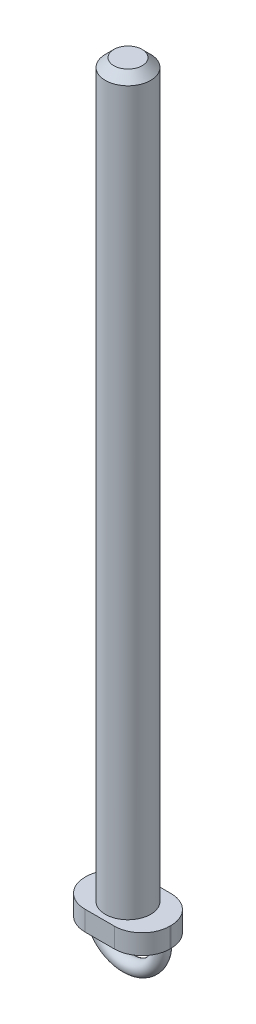
ISO-10303-21;
HEADER;
FILE_DESCRIPTION(('STEP AP214'),'2;1');
FILE_NAME('part.step','',(''),(''),'','','');
FILE_SCHEMA(('AUTOMOTIVE_DESIGN { 1 0 10303 214 1 1 1 1 }'));
ENDSEC;
DATA;
#1=APPLICATION_CONTEXT('core data for automotive mechanical design processes');
#2=APPLICATION_PROTOCOL_DEFINITION('international standard','automotive_design',2000,#1);
#3=PRODUCT_CONTEXT('',#1,'mechanical');
#4=PRODUCT('Part','Part','',(#3));
#5=PRODUCT_RELATED_PRODUCT_CATEGORY('part','',(#4));
#6=PRODUCT_DEFINITION_FORMATION('','',#4);
#7=PRODUCT_DEFINITION_CONTEXT('part definition',#1,'design');
#8=PRODUCT_DEFINITION('design','',#6,#7);
#9=PRODUCT_DEFINITION_SHAPE('','',#8);
#10=(LENGTH_UNIT() NAMED_UNIT(*) SI_UNIT(.MILLI.,.METRE.));
#11=(NAMED_UNIT(*) PLANE_ANGLE_UNIT() SI_UNIT($,.RADIAN.));
#12=(NAMED_UNIT(*) SI_UNIT($,.STERADIAN.) SOLID_ANGLE_UNIT());
#13=UNCERTAINTY_MEASURE_WITH_UNIT(LENGTH_MEASURE(1.E-05),#10,'distance_accuracy_value','');
#14=(GEOMETRIC_REPRESENTATION_CONTEXT(3) GLOBAL_UNCERTAINTY_ASSIGNED_CONTEXT((#13)) GLOBAL_UNIT_ASSIGNED_CONTEXT((#10,
#11,#12)) REPRESENTATION_CONTEXT('',''));
#15=CARTESIAN_POINT('',(0.,0.,0.));
#16=DIRECTION('',(0.,0.,1.));
#17=DIRECTION('',(1.,0.,0.));
#18=AXIS2_PLACEMENT_3D('',#15,#16,#17);
#19=CARTESIAN_POINT('',(0.,0.,0.));
#20=DIRECTION('',(0.,1.,0.));
#21=DIRECTION('',(-1.,0.,0.));
#22=AXIS2_PLACEMENT_3D('',#19,#20,#21);
#23=PLANE('',#22);
#24=CARTESIAN_POINT('',(6.,0.,0.));
#25=DIRECTION('',(0.,1.,0.));
#26=DIRECTION('',(-1.,0.,0.));
#27=AXIS2_PLACEMENT_3D('',#24,#25,#26);
#28=CIRCLE('',#27,1.25);
#29=CARTESIAN_POINT('',(7.25,1.02880155875736E-13,0.));
#30=VERTEX_POINT('',#29);
#31=EDGE_CURVE('E172',#30,#30,#28,.T.);
#32=ORIENTED_EDGE('',*,*,#31,.T.);
#33=EDGE_LOOP('',(#32));
#34=FACE_BOUND('',#33,.T.);
#35=CARTESIAN_POINT('',(2.6,0.,-0.0999999999999985));
#36=DIRECTION('',(0.,-1.,0.));
#37=DIRECTION('',(1.,0.,0.));
#38=AXIS2_PLACEMENT_3D('',#35,#36,#37);
#39=CIRCLE('',#38,4.9);
#40=CARTESIAN_POINT('',(2.59999999999996,0.,-5.));
#41=VERTEX_POINT('',#40);
#42=CARTESIAN_POINT('',(7.5,0.,-0.0999999999999638));
#43=VERTEX_POINT('',#42);
#44=EDGE_CURVE('E48',#41,#43,#39,.T.);
#45=ORIENTED_EDGE('',*,*,#44,.T.);
#46=DIRECTION('',(0.,0.,1.));
#47=VECTOR('',#46,1.);
#48=CARTESIAN_POINT('',(7.5,0.,0.));
#49=LINE('',#48,#47);
#50=CARTESIAN_POINT('',(7.5,0.,0.0999999999999656));
#51=VERTEX_POINT('',#50);
#52=EDGE_CURVE('E130',#43,#51,#49,.T.);
#53=ORIENTED_EDGE('',*,*,#52,.T.);
#54=CARTESIAN_POINT('',(2.6,0.,0.1));
#55=DIRECTION('',(0.,-1.,0.));
#56=DIRECTION('',(1.,0.,0.));
#57=AXIS2_PLACEMENT_3D('',#54,#55,#56);
#58=CIRCLE('',#57,4.9);
#59=CARTESIAN_POINT('',(2.59999999999996,0.,5.));
#60=VERTEX_POINT('',#59);
#61=EDGE_CURVE('E127',#51,#60,#58,.T.);
#62=ORIENTED_EDGE('',*,*,#61,.T.);
#63=DIRECTION('',(-1.,0.,0.));
#64=VECTOR('',#63,1.);
#65=CARTESIAN_POINT('',(0.,0.,5.));
#66=LINE('',#65,#64);
#67=CARTESIAN_POINT('',(-2.59999999999996,0.,5.));
#68=VERTEX_POINT('',#67);
#69=EDGE_CURVE('E124',#60,#68,#66,.T.);
#70=ORIENTED_EDGE('',*,*,#69,.T.);
#71=CARTESIAN_POINT('',(-2.6,0.,0.0999999999999985));
#72=DIRECTION('',(0.,-1.,0.));
#73=DIRECTION('',(1.,0.,0.));
#74=AXIS2_PLACEMENT_3D('',#71,#72,#73);
#75=CIRCLE('',#74,4.9);
#76=CARTESIAN_POINT('',(-7.5,0.,0.0999999999999638));
#77=VERTEX_POINT('',#76);
#78=EDGE_CURVE('E119',#68,#77,#75,.T.);
#79=ORIENTED_EDGE('',*,*,#78,.T.);
#80=DIRECTION('',(0.,0.,1.));
#81=VECTOR('',#80,1.);
#82=CARTESIAN_POINT('',(-7.5,0.,0.));
#83=LINE('',#82,#81);
#84=CARTESIAN_POINT('',(-7.5,0.,-0.0999999999999656));
#85=VERTEX_POINT('',#84);
#86=EDGE_CURVE('E117',#85,#77,#83,.T.);
#87=ORIENTED_EDGE('',*,*,#86,.F.);
#88=CARTESIAN_POINT('',(-2.6,0.,-0.0999999999999994));
#89=DIRECTION('',(0.,-1.,0.));
#90=DIRECTION('',(1.,0.,0.));
#91=AXIS2_PLACEMENT_3D('',#88,#89,#90);
#92=CIRCLE('',#91,4.9);
#93=CARTESIAN_POINT('',(-2.59999999999996,0.,-5.));
#94=VERTEX_POINT('',#93);
#95=EDGE_CURVE('E101',#94,#85,#92,.F.);
#96=ORIENTED_EDGE('',*,*,#95,.F.);
#97=DIRECTION('',(-1.,0.,0.));
#98=VECTOR('',#97,1.);
#99=CARTESIAN_POINT('',(0.,0.,-5.));
#100=LINE('',#99,#98);
#101=EDGE_CURVE('E110',#41,#94,#100,.T.);
#102=ORIENTED_EDGE('',*,*,#101,.F.);
#103=EDGE_LOOP('',(#45,#53,#62,#70,#79,#87,#96,#102));
#104=FACE_BOUND('',#103,.T.);
#105=CARTESIAN_POINT('',(-6.,0.,0.));
#106=DIRECTION('',(0.,-1.,0.));
#107=DIRECTION('',(1.,0.,0.));
#108=AXIS2_PLACEMENT_3D('',#105,#106,#107);
#109=CIRCLE('',#108,1.25);
#110=CARTESIAN_POINT('',(-7.25,0.,0.));
#111=VERTEX_POINT('',#110);
#112=EDGE_CURVE('E163',#111,#111,#109,.T.);
#113=ORIENTED_EDGE('',*,*,#112,.F.);
#114=EDGE_LOOP('',(#113));
#115=FACE_BOUND('',#114,.T.);
#116=ADVANCED_FACE('F33',(#34,#104,#115),#23,.F.);
#117=CARTESIAN_POINT('',(11.,3.5,0.));
#118=DIRECTION('',(0.,-1.,0.));
#119=DIRECTION('',(1.,0.,0.));
#120=AXIS2_PLACEMENT_3D('',#117,#118,#119);
#121=PLANE('',#120);
#122=CARTESIAN_POINT('',(0.,3.5,0.));
#123=DIRECTION('',(0.,1.,0.));
#124=DIRECTION('',(-1.,0.,0.));
#125=AXIS2_PLACEMENT_3D('',#122,#123,#124);
#126=CIRCLE('',#125,4.);
#127=CARTESIAN_POINT('',(-4.,3.5,0.));
#128=VERTEX_POINT('',#127);
#129=EDGE_CURVE('E135',#128,#128,#126,.T.);
#130=ORIENTED_EDGE('',*,*,#129,.F.);
#131=EDGE_LOOP('',(#130));
#132=FACE_BOUND('',#131,.T.);
#133=CARTESIAN_POINT('',(2.6,3.5,-0.0999999999999985));
#134=DIRECTION('',(0.,-1.,0.));
#135=DIRECTION('',(1.,0.,0.));
#136=AXIS2_PLACEMENT_3D('',#133,#134,#135);
#137=CIRCLE('',#136,4.9);
#138=CARTESIAN_POINT('',(2.59999999999996,3.5,-5.));
#139=VERTEX_POINT('',#138);
#140=CARTESIAN_POINT('',(7.5,3.5,-0.0999999999999638));
#141=VERTEX_POINT('',#140);
#142=EDGE_CURVE('E162',#139,#141,#137,.T.);
#143=ORIENTED_EDGE('',*,*,#142,.F.);
#144=DIRECTION('',(-1.,0.,0.));
#145=VECTOR('',#144,1.);
#146=CARTESIAN_POINT('',(11.,3.5,-5.));
#147=LINE('',#146,#145);
#148=CARTESIAN_POINT('',(-2.59999999999997,3.5,-5.));
#149=VERTEX_POINT('',#148);
#150=EDGE_CURVE('E148',#139,#149,#147,.T.);
#151=ORIENTED_EDGE('',*,*,#150,.T.);
#152=CARTESIAN_POINT('',(-2.6,3.5,-0.0999999999999994));
#153=DIRECTION('',(0.,-1.,0.));
#154=DIRECTION('',(1.,0.,0.));
#155=AXIS2_PLACEMENT_3D('',#152,#153,#154);
#156=CIRCLE('',#155,4.9);
#157=CARTESIAN_POINT('',(-7.5,3.5,-0.0999999999999656));
#158=VERTEX_POINT('',#157);
#159=EDGE_CURVE('E104',#149,#158,#156,.F.);
#160=ORIENTED_EDGE('',*,*,#159,.T.);
#161=DIRECTION('',(0.,0.,1.));
#162=VECTOR('',#161,1.);
#163=CARTESIAN_POINT('',(-7.5,3.5,0.));
#164=LINE('',#163,#162);
#165=CARTESIAN_POINT('',(-7.5,3.5,0.0999999999999638));
#166=VERTEX_POINT('',#165);
#167=EDGE_CURVE('E151',#158,#166,#164,.T.);
#168=ORIENTED_EDGE('',*,*,#167,.T.);
#169=CARTESIAN_POINT('',(-2.6,3.5,0.0999999999999985));
#170=DIRECTION('',(0.,-1.,0.));
#171=DIRECTION('',(1.,0.,0.));
#172=AXIS2_PLACEMENT_3D('',#169,#170,#171);
#173=CIRCLE('',#172,4.9);
#174=CARTESIAN_POINT('',(-2.59999999999996,3.5,5.));
#175=VERTEX_POINT('',#174);
#176=EDGE_CURVE('E154',#175,#166,#173,.T.);
#177=ORIENTED_EDGE('',*,*,#176,.F.);
#178=DIRECTION('',(-1.,0.,0.));
#179=VECTOR('',#178,1.);
#180=CARTESIAN_POINT('',(11.,3.5,5.));
#181=LINE('',#180,#179);
#182=CARTESIAN_POINT('',(2.59999999999996,3.5,5.));
#183=VERTEX_POINT('',#182);
#184=EDGE_CURVE('E156',#183,#175,#181,.T.);
#185=ORIENTED_EDGE('',*,*,#184,.F.);
#186=CARTESIAN_POINT('',(2.6,3.5,0.1));
#187=DIRECTION('',(0.,-1.,0.));
#188=DIRECTION('',(1.,0.,0.));
#189=AXIS2_PLACEMENT_3D('',#186,#187,#188);
#190=CIRCLE('',#189,4.9);
#191=CARTESIAN_POINT('',(7.5,3.5,0.0999999999999656));
#192=VERTEX_POINT('',#191);
#193=EDGE_CURVE('E158',#192,#183,#190,.T.);
#194=ORIENTED_EDGE('',*,*,#193,.F.);
#195=DIRECTION('',(0.,0.,1.));
#196=VECTOR('',#195,1.);
#197=CARTESIAN_POINT('',(7.5,3.5,0.));
#198=LINE('',#197,#196);
#199=EDGE_CURVE('E160',#141,#192,#198,.T.);
#200=ORIENTED_EDGE('',*,*,#199,.F.);
#201=EDGE_LOOP('',(#143,#151,#160,#168,#177,#185,#194,#200));
#202=FACE_BOUND('',#201,.T.);
#203=ADVANCED_FACE('F199',(#132,#202),#121,.F.);
#204=CARTESIAN_POINT('',(0.,132.66,0.));
#205=DIRECTION('',(0.,1.,0.));
#206=DIRECTION('',(-1.,0.,0.));
#207=AXIS2_PLACEMENT_3D('',#204,#205,#206);
#208=CYLINDRICAL_SURFACE('',#207,4.00000000000002);
#209=CARTESIAN_POINT('',(0.,131.16,0.));
#210=DIRECTION('',(0.,-1.,0.));
#211=DIRECTION('',(1.,0.,0.));
#212=AXIS2_PLACEMENT_3D('',#209,#210,#211);
#213=CIRCLE('',#212,4.00000000000002);
#214=CARTESIAN_POINT('',(4.,131.16,0.));
#215=VERTEX_POINT('',#214);
#216=EDGE_CURVE('E11',#215,#215,#213,.T.);
#217=ORIENTED_EDGE('',*,*,#216,.T.);
#218=EDGE_LOOP('',(#217));
#219=FACE_BOUND('',#218,.T.);
#220=ORIENTED_EDGE('',*,*,#129,.T.);
#221=EDGE_LOOP('',(#220));
#222=FACE_BOUND('',#221,.T.);
#223=ADVANCED_FACE('F210',(#219,#222),#208,.T.);
#224=CARTESIAN_POINT('',(4.00000000000002,132.66,0.));
#225=DIRECTION('',(0.,-1.,0.));
#226=DIRECTION('',(1.,0.,0.));
#227=AXIS2_PLACEMENT_3D('',#224,#225,#226);
#228=PLANE('',#227);
#229=CARTESIAN_POINT('',(0.,132.66,0.));
#230=DIRECTION('',(0.,-1.,0.));
#231=DIRECTION('',(1.,0.,0.));
#232=AXIS2_PLACEMENT_3D('',#229,#230,#231);
#233=CIRCLE('',#232,2.50000000000004);
#234=CARTESIAN_POINT('',(2.50000000000003,132.66,0.));
#235=VERTEX_POINT('',#234);
#236=EDGE_CURVE('E41',#235,#235,#233,.F.);
#237=ORIENTED_EDGE('',*,*,#236,.T.);
#238=EDGE_LOOP('',(#237));
#239=FACE_BOUND('',#238,.T.);
#240=ADVANCED_FACE('F202',(#239),#228,.F.);
#241=CARTESIAN_POINT('',(2.6,10.,-0.0999999999999985));
#242=DIRECTION('',(0.,-1.,0.));
#243=DIRECTION('',(1.,0.,0.));
#244=AXIS2_PLACEMENT_3D('',#241,#242,#243);
#245=CYLINDRICAL_SURFACE('',#244,4.9);
#246=ORIENTED_EDGE('',*,*,#142,.T.);
#247=DIRECTION('',(0.,-1.,0.));
#248=VECTOR('',#247,1.);
#249=CARTESIAN_POINT('',(7.5,10.,-0.0999999999999638));
#250=LINE('',#249,#248);
#251=EDGE_CURVE('E133',#141,#43,#250,.T.);
#252=ORIENTED_EDGE('',*,*,#251,.T.);
#253=ORIENTED_EDGE('',*,*,#44,.F.);
#254=DIRECTION('',(0.,-1.,0.));
#255=VECTOR('',#254,1.);
#256=CARTESIAN_POINT('',(2.59999999999996,10.,-5.));
#257=LINE('',#256,#255);
#258=EDGE_CURVE('E107',#139,#41,#257,.T.);
#259=ORIENTED_EDGE('',*,*,#258,.F.);
#260=EDGE_LOOP('',(#246,#252,#253,#259));
#261=FACE_BOUND('',#260,.T.);
#262=ADVANCED_FACE('F200',(#261),#245,.T.);
#263=CARTESIAN_POINT('',(7.5,10.,0.));
#264=DIRECTION('',(1.,0.,0.));
#265=DIRECTION('',(0.,1.,0.));
#266=AXIS2_PLACEMENT_3D('',#263,#264,#265);
#267=PLANE('',#266);
#268=ORIENTED_EDGE('',*,*,#199,.T.);
#269=DIRECTION('',(0.,-1.,0.));
#270=VECTOR('',#269,1.);
#271=CARTESIAN_POINT('',(7.5,10.,0.0999999999999656));
#272=LINE('',#271,#270);
#273=EDGE_CURVE('E136',#192,#51,#272,.T.);
#274=ORIENTED_EDGE('',*,*,#273,.T.);
#275=ORIENTED_EDGE('',*,*,#52,.F.);
#276=ORIENTED_EDGE('',*,*,#251,.F.);
#277=EDGE_LOOP('',(#268,#274,#275,#276));
#278=FACE_BOUND('',#277,.T.);
#279=ADVANCED_FACE('F178',(#278),#267,.T.);
#280=CARTESIAN_POINT('',(2.6,10.,0.1));
#281=DIRECTION('',(0.,-1.,0.));
#282=DIRECTION('',(1.,0.,0.));
#283=AXIS2_PLACEMENT_3D('',#280,#281,#282);
#284=CYLINDRICAL_SURFACE('',#283,4.9);
#285=ORIENTED_EDGE('',*,*,#193,.T.);
#286=DIRECTION('',(0.,-1.,0.));
#287=VECTOR('',#286,1.);
#288=CARTESIAN_POINT('',(2.59999999999996,10.,5.));
#289=LINE('',#288,#287);
#290=EDGE_CURVE('E138',#183,#60,#289,.T.);
#291=ORIENTED_EDGE('',*,*,#290,.T.);
#292=ORIENTED_EDGE('',*,*,#61,.F.);
#293=ORIENTED_EDGE('',*,*,#273,.F.);
#294=EDGE_LOOP('',(#285,#291,#292,#293));
#295=FACE_BOUND('',#294,.T.);
#296=ADVANCED_FACE('F183',(#295),#284,.T.);
#297=CARTESIAN_POINT('',(0.,10.,5.));
#298=DIRECTION('',(0.,0.,1.));
#299=DIRECTION('',(1.,0.,0.));
#300=AXIS2_PLACEMENT_3D('',#297,#298,#299);
#301=PLANE('',#300);
#302=ORIENTED_EDGE('',*,*,#184,.T.);
#303=DIRECTION('',(0.,-1.,0.));
#304=VECTOR('',#303,1.);
#305=CARTESIAN_POINT('',(-2.59999999999997,10.,5.));
#306=LINE('',#305,#304);
#307=EDGE_CURVE('E140',#175,#68,#306,.T.);
#308=ORIENTED_EDGE('',*,*,#307,.T.);
#309=ORIENTED_EDGE('',*,*,#69,.F.);
#310=ORIENTED_EDGE('',*,*,#290,.F.);
#311=EDGE_LOOP('',(#302,#308,#309,#310));
#312=FACE_BOUND('',#311,.T.);
#313=ADVANCED_FACE('F188',(#312),#301,.T.);
#314=CARTESIAN_POINT('',(-2.6,10.,0.0999999999999985));
#315=DIRECTION('',(0.,-1.,0.));
#316=DIRECTION('',(1.,0.,0.));
#317=AXIS2_PLACEMENT_3D('',#314,#315,#316);
#318=CYLINDRICAL_SURFACE('',#317,4.9);
#319=ORIENTED_EDGE('',*,*,#176,.T.);
#320=DIRECTION('',(0.,-1.,0.));
#321=VECTOR('',#320,1.);
#322=CARTESIAN_POINT('',(-7.5,10.,0.0999999999999638));
#323=LINE('',#322,#321);
#324=EDGE_CURVE('E142',#166,#77,#323,.T.);
#325=ORIENTED_EDGE('',*,*,#324,.T.);
#326=ORIENTED_EDGE('',*,*,#78,.F.);
#327=ORIENTED_EDGE('',*,*,#307,.F.);
#328=EDGE_LOOP('',(#319,#325,#326,#327));
#329=FACE_BOUND('',#328,.T.);
#330=ADVANCED_FACE('F192',(#329),#318,.T.);
#331=CARTESIAN_POINT('',(-7.5,10.,0.));
#332=DIRECTION('',(1.,0.,0.));
#333=DIRECTION('',(0.,1.,0.));
#334=AXIS2_PLACEMENT_3D('',#331,#332,#333);
#335=PLANE('',#334);
#336=DIRECTION('',(0.,-1.,0.));
#337=VECTOR('',#336,1.);
#338=CARTESIAN_POINT('',(-7.5,10.,-0.0999999999999656));
#339=LINE('',#338,#337);
#340=EDGE_CURVE('E106',#158,#85,#339,.T.);
#341=ORIENTED_EDGE('',*,*,#340,.T.);
#342=ORIENTED_EDGE('',*,*,#86,.T.);
#343=ORIENTED_EDGE('',*,*,#324,.F.);
#344=ORIENTED_EDGE('',*,*,#167,.F.);
#345=EDGE_LOOP('',(#341,#342,#343,#344));
#346=FACE_BOUND('',#345,.T.);
#347=ADVANCED_FACE('F196',(#346),#335,.F.);
#348=CARTESIAN_POINT('',(-2.6,10.,-0.0999999999999994));
#349=DIRECTION('',(0.,-1.,0.));
#350=DIRECTION('',(1.,0.,0.));
#351=AXIS2_PLACEMENT_3D('',#348,#349,#350);
#352=CYLINDRICAL_SURFACE('',#351,4.9);
#353=DIRECTION('',(0.,-1.,0.));
#354=VECTOR('',#353,1.);
#355=CARTESIAN_POINT('',(-2.59999999999997,10.,-5.));
#356=LINE('',#355,#354);
#357=EDGE_CURVE('E56',#149,#94,#356,.T.);
#358=ORIENTED_EDGE('',*,*,#357,.T.);
#359=ORIENTED_EDGE('',*,*,#95,.T.);
#360=ORIENTED_EDGE('',*,*,#340,.F.);
#361=ORIENTED_EDGE('',*,*,#159,.F.);
#362=EDGE_LOOP('',(#358,#359,#360,#361));
#363=FACE_BOUND('',#362,.T.);
#364=ADVANCED_FACE('F98',(#363),#352,.T.);
#365=CARTESIAN_POINT('',(0.,10.,-5.));
#366=DIRECTION('',(0.,0.,1.));
#367=DIRECTION('',(1.,0.,0.));
#368=AXIS2_PLACEMENT_3D('',#365,#366,#367);
#369=PLANE('',#368);
#370=ORIENTED_EDGE('',*,*,#258,.T.);
#371=ORIENTED_EDGE('',*,*,#101,.T.);
#372=ORIENTED_EDGE('',*,*,#357,.F.);
#373=ORIENTED_EDGE('',*,*,#150,.F.);
#374=EDGE_LOOP('',(#370,#371,#372,#373));
#375=FACE_BOUND('',#374,.T.);
#376=ADVANCED_FACE('F111',(#375),#369,.F.);
#377=CARTESIAN_POINT('',(0.,0.,0.));
#378=DIRECTION('',(0.,0.,-1.));
#379=DIRECTION('',(-1.,0.,0.));
#380=AXIS2_PLACEMENT_3D('',#377,#378,#379);
#381=TOROIDAL_SURFACE('',#380,6.,1.25);
#382=CARTESIAN_POINT('',(0.,0.,0.));
#383=DIRECTION('',(0.,0.,-1.));
#384=DIRECTION('',(-1.,0.,0.));
#385=AXIS2_PLACEMENT_3D('',#382,#383,#384);
#386=CIRCLE('',#385,7.25);
#387=EDGE_CURVE('',#30,#111,#386,.T.);
#388=ORIENTED_EDGE('',*,*,#31,.F.);
#389=ORIENTED_EDGE('',*,*,#112,.T.);
#390=ORIENTED_EDGE('',*,*,#387,.T.);
#391=ORIENTED_EDGE('',*,*,#387,.F.);
#392=EDGE_LOOP('',(#388,#390,#389,#391));
#393=FACE_BOUND('',#392,.T.);
#394=ADVANCED_FACE('F232',(#393),#381,.T.);
#395=CARTESIAN_POINT('',(0.,132.66,0.));
#396=DIRECTION('',(0.,-1.,0.));
#397=DIRECTION('',(1.,0.,0.));
#398=AXIS2_PLACEMENT_3D('',#395,#396,#397);
#399=CONICAL_SURFACE('',#398,2.50000000000004,0.785398163397448);
#400=ORIENTED_EDGE('',*,*,#216,.F.);
#401=EDGE_LOOP('',(#400));
#402=FACE_BOUND('',#401,.T.);
#403=ORIENTED_EDGE('',*,*,#236,.F.);
#404=EDGE_LOOP('',(#403));
#405=FACE_BOUND('',#404,.T.);
#406=ADVANCED_FACE('F35',(#402,#405),#399,.T.);
#407=CLOSED_SHELL('',(#116,#203,#223,#240,#262,#279,#296,#313,#330,#347,#364,#376,#394,#406));
#408=MANIFOLD_SOLID_BREP('B2',#407);
#409=ADVANCED_BREP_SHAPE_REPRESENTATION('',(#18,#408),#14);
#410=SHAPE_DEFINITION_REPRESENTATION(#9,#409);
ENDSEC;
END-ISO-10303-21;
